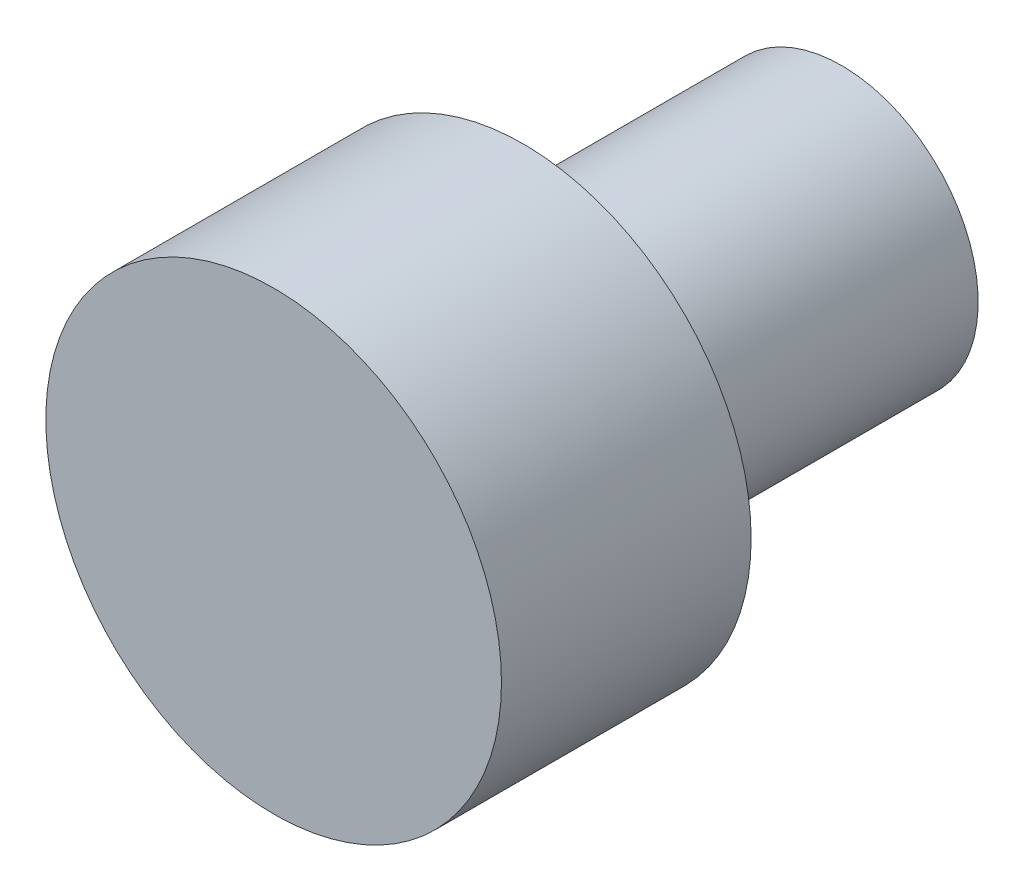
ISO-10303-21;
HEADER;
FILE_DESCRIPTION(('STEP AP214'),'2;1');
FILE_NAME('part.step','',(''),(''),'','','');
FILE_SCHEMA(('AUTOMOTIVE_DESIGN { 1 0 10303 214 1 1 1 1 }'));
ENDSEC;
DATA;
#1=APPLICATION_CONTEXT('core data for automotive mechanical design processes');
#2=APPLICATION_PROTOCOL_DEFINITION('international standard','automotive_design',2000,#1);
#3=PRODUCT_CONTEXT('',#1,'mechanical');
#4=PRODUCT('Part','Part','',(#3));
#5=PRODUCT_RELATED_PRODUCT_CATEGORY('part','',(#4));
#6=PRODUCT_DEFINITION_FORMATION('','',#4);
#7=PRODUCT_DEFINITION_CONTEXT('part definition',#1,'design');
#8=PRODUCT_DEFINITION('design','',#6,#7);
#9=PRODUCT_DEFINITION_SHAPE('','',#8);
#10=(LENGTH_UNIT() NAMED_UNIT(*) SI_UNIT(.MILLI.,.METRE.));
#11=(NAMED_UNIT(*) PLANE_ANGLE_UNIT() SI_UNIT($,.RADIAN.));
#12=(NAMED_UNIT(*) SI_UNIT($,.STERADIAN.) SOLID_ANGLE_UNIT());
#13=UNCERTAINTY_MEASURE_WITH_UNIT(LENGTH_MEASURE(1.E-05),#10,'distance_accuracy_value','');
#14=(GEOMETRIC_REPRESENTATION_CONTEXT(3) GLOBAL_UNCERTAINTY_ASSIGNED_CONTEXT((#13)) GLOBAL_UNIT_ASSIGNED_CONTEXT((#10,
#11,#12)) REPRESENTATION_CONTEXT('',''));
#15=CARTESIAN_POINT('',(0.,0.,0.));
#16=DIRECTION('',(0.,0.,1.));
#17=DIRECTION('',(1.,0.,0.));
#18=AXIS2_PLACEMENT_3D('',#15,#16,#17);
#19=CARTESIAN_POINT('',(0.,0.,10.16));
#20=DIRECTION('',(0.,0.,-1.));
#21=DIRECTION('',(-1.,0.,0.));
#22=AXIS2_PLACEMENT_3D('',#19,#20,#21);
#23=CYLINDRICAL_SURFACE('',#22,9.271);
#24=CARTESIAN_POINT('',(0.,0.,10.16));
#25=DIRECTION('',(0.,0.,1.));
#26=DIRECTION('',(1.,0.,0.));
#27=AXIS2_PLACEMENT_3D('',#24,#25,#26);
#28=CIRCLE('',#27,9.271);
#29=CARTESIAN_POINT('',(9.271,0.,10.16));
#30=VERTEX_POINT('',#29);
#31=EDGE_CURVE('E45',#30,#30,#28,.T.);
#32=ORIENTED_EDGE('',*,*,#31,.F.);
#33=EDGE_LOOP('',(#32));
#34=FACE_BOUND('',#33,.T.);
#35=CARTESIAN_POINT('',(0.,0.,0.));
#36=DIRECTION('',(0.,0.,1.));
#37=DIRECTION('',(1.,0.,0.));
#38=AXIS2_PLACEMENT_3D('',#35,#36,#37);
#39=CIRCLE('',#38,9.271);
#40=CARTESIAN_POINT('',(9.271,0.,0.));
#41=VERTEX_POINT('',#40);
#42=EDGE_CURVE('E40',#41,#41,#39,.T.);
#43=ORIENTED_EDGE('',*,*,#42,.T.);
#44=EDGE_LOOP('',(#43));
#45=FACE_BOUND('',#44,.T.);
#46=ADVANCED_FACE('F37',(#34,#45),#23,.T.);
#47=CARTESIAN_POINT('',(0.,0.,10.16));
#48=DIRECTION('',(0.,0.,1.));
#49=DIRECTION('',(1.,0.,0.));
#50=AXIS2_PLACEMENT_3D('',#47,#48,#49);
#51=PLANE('',#50);
#52=ORIENTED_EDGE('',*,*,#31,.T.);
#53=EDGE_LOOP('',(#52));
#54=FACE_BOUND('',#53,.T.);
#55=ADVANCED_FACE('F65',(#54),#51,.T.);
#56=CARTESIAN_POINT('',(0.,0.,0.));
#57=DIRECTION('',(0.,0.,1.));
#58=DIRECTION('',(1.,0.,0.));
#59=AXIS2_PLACEMENT_3D('',#56,#57,#58);
#60=PLANE('',#59);
#61=CARTESIAN_POINT('',(0.,0.,0.));
#62=DIRECTION('',(0.,0.,-1.));
#63=DIRECTION('',(-1.,0.,0.));
#64=AXIS2_PLACEMENT_3D('',#61,#62,#63);
#65=CIRCLE('',#64,5.55625);
#66=CARTESIAN_POINT('',(-5.55625,0.,0.));
#67=VERTEX_POINT('',#66);
#68=EDGE_CURVE('E10',#67,#67,#65,.T.);
#69=ORIENTED_EDGE('',*,*,#68,.F.);
#70=EDGE_LOOP('',(#69));
#71=FACE_BOUND('',#70,.T.);
#72=ORIENTED_EDGE('',*,*,#42,.F.);
#73=EDGE_LOOP('',(#72));
#74=FACE_BOUND('',#73,.T.);
#75=ADVANCED_FACE('F62',(#71,#74),#60,.F.);
#76=CARTESIAN_POINT('',(0.,0.,-12.954));
#77=DIRECTION('',(0.,0.,1.));
#78=DIRECTION('',(1.,0.,0.));
#79=AXIS2_PLACEMENT_3D('',#76,#77,#78);
#80=CYLINDRICAL_SURFACE('',#79,5.55625);
#81=CARTESIAN_POINT('',(0.,0.,-12.954));
#82=DIRECTION('',(0.,0.,-1.));
#83=DIRECTION('',(-1.,0.,0.));
#84=AXIS2_PLACEMENT_3D('',#81,#82,#83);
#85=CIRCLE('',#84,5.55625);
#86=CARTESIAN_POINT('',(-5.55625,0.,-12.954));
#87=VERTEX_POINT('',#86);
#88=EDGE_CURVE('E52',#87,#87,#85,.T.);
#89=ORIENTED_EDGE('',*,*,#88,.F.);
#90=EDGE_LOOP('',(#89));
#91=FACE_BOUND('',#90,.T.);
#92=ORIENTED_EDGE('',*,*,#68,.T.);
#93=EDGE_LOOP('',(#92));
#94=FACE_BOUND('',#93,.T.);
#95=ADVANCED_FACE('F64',(#91,#94),#80,.T.);
#96=CARTESIAN_POINT('',(0.,0.,-12.954));
#97=DIRECTION('',(0.,0.,-1.));
#98=DIRECTION('',(-1.,0.,0.));
#99=AXIS2_PLACEMENT_3D('',#96,#97,#98);
#100=PLANE('',#99);
#101=ORIENTED_EDGE('',*,*,#88,.T.);
#102=EDGE_LOOP('',(#101));
#103=FACE_BOUND('',#102,.T.);
#104=ADVANCED_FACE('F71',(#103),#100,.T.);
#105=CLOSED_SHELL('',(#46,#55,#75,#95,#104));
#106=MANIFOLD_SOLID_BREP('B2',#105);
#107=ADVANCED_BREP_SHAPE_REPRESENTATION('',(#18,#106),#14);
#108=SHAPE_DEFINITION_REPRESENTATION(#9,#107);
ENDSEC;
END-ISO-10303-21;
